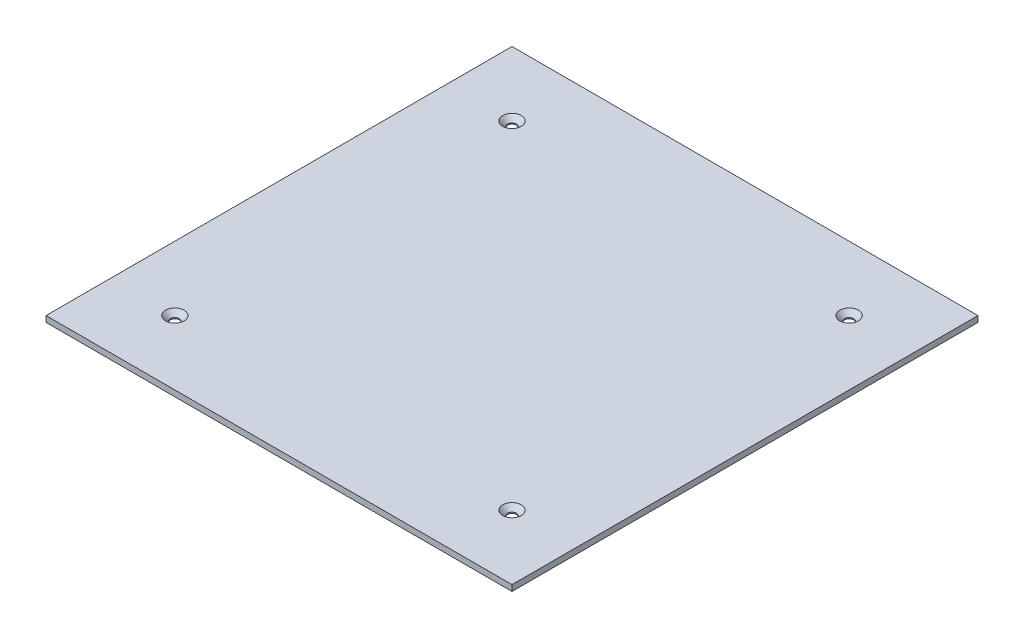
ISO-10303-21;
HEADER;
FILE_DESCRIPTION(('STEP AP214'),'2;1');
FILE_NAME('part.step','',(''),(''),'','','');
FILE_SCHEMA(('AUTOMOTIVE_DESIGN { 1 0 10303 214 1 1 1 1 }'));
ENDSEC;
DATA;
#1=APPLICATION_CONTEXT('core data for automotive mechanical design processes');
#2=APPLICATION_PROTOCOL_DEFINITION('international standard','automotive_design',2000,#1);
#3=PRODUCT_CONTEXT('',#1,'mechanical');
#4=PRODUCT('Part','Part','',(#3));
#5=PRODUCT_RELATED_PRODUCT_CATEGORY('part','',(#4));
#6=PRODUCT_DEFINITION_FORMATION('','',#4);
#7=PRODUCT_DEFINITION_CONTEXT('part definition',#1,'design');
#8=PRODUCT_DEFINITION('design','',#6,#7);
#9=PRODUCT_DEFINITION_SHAPE('','',#8);
#10=(LENGTH_UNIT() NAMED_UNIT(*) SI_UNIT(.MILLI.,.METRE.));
#11=(NAMED_UNIT(*) PLANE_ANGLE_UNIT() SI_UNIT($,.RADIAN.));
#12=(NAMED_UNIT(*) SI_UNIT($,.STERADIAN.) SOLID_ANGLE_UNIT());
#13=UNCERTAINTY_MEASURE_WITH_UNIT(LENGTH_MEASURE(1.E-05),#10,'distance_accuracy_value','');
#14=(GEOMETRIC_REPRESENTATION_CONTEXT(3) GLOBAL_UNCERTAINTY_ASSIGNED_CONTEXT((#13)) GLOBAL_UNIT_ASSIGNED_CONTEXT((#10,
#11,#12)) REPRESENTATION_CONTEXT('',''));
#15=CARTESIAN_POINT('',(0.,0.,0.));
#16=DIRECTION('',(0.,0.,1.));
#17=DIRECTION('',(1.,0.,0.));
#18=AXIS2_PLACEMENT_3D('',#15,#16,#17);
#19=CARTESIAN_POINT('',(0.,0.,0.));
#20=DIRECTION('',(0.,1.,0.));
#21=DIRECTION('',(0.,0.,1.));
#22=AXIS2_PLACEMENT_3D('',#19,#20,#21);
#23=PLANE('',#22);
#24=DIRECTION('',(0.,0.,-1.));
#25=VECTOR('',#24,1.);
#26=CARTESIAN_POINT('',(-69.5,0.,-109.5));
#27=LINE('',#26,#25);
#28=CARTESIAN_POINT('',(-69.5,0.,-97.5));
#29=VERTEX_POINT('',#28);
#30=CARTESIAN_POINT('',(-69.5,0.,-109.5));
#31=VERTEX_POINT('',#30);
#32=EDGE_CURVE('E166',#29,#31,#27,.T.);
#33=ORIENTED_EDGE('',*,*,#32,.F.);
#34=DIRECTION('',(-1.,0.,0.));
#35=VECTOR('',#34,1.);
#36=CARTESIAN_POINT('',(-69.5,0.,-97.5));
#37=LINE('',#36,#35);
#38=CARTESIAN_POINT('',(-59.5,0.,-97.5));
#39=VERTEX_POINT('',#38);
#40=EDGE_CURVE('E181',#39,#29,#37,.T.);
#41=ORIENTED_EDGE('',*,*,#40,.F.);
#42=DIRECTION('',(0.,0.,1.));
#43=VECTOR('',#42,1.);
#44=CARTESIAN_POINT('',(-59.5,0.,-109.5));
#45=LINE('',#44,#43);
#46=CARTESIAN_POINT('',(-59.5,0.,-109.5));
#47=VERTEX_POINT('',#46);
#48=EDGE_CURVE('E193',#47,#39,#45,.T.);
#49=ORIENTED_EDGE('',*,*,#48,.F.);
#50=DIRECTION('',(1.,0.,0.));
#51=VECTOR('',#50,1.);
#52=CARTESIAN_POINT('',(-69.5,0.,-109.5));
#53=LINE('',#52,#51);
#54=EDGE_CURVE('E170',#31,#47,#53,.T.);
#55=ORIENTED_EDGE('',*,*,#54,.F.);
#56=EDGE_LOOP('',(#33,#41,#49,#55));
#57=FACE_BOUND('',#56,.T.);
#58=CARTESIAN_POINT('',(-85.0000000000001,0.,-85.000000000001));
#59=DIRECTION('',(0.,1.,0.));
#60=DIRECTION('',(0.,0.,1.));
#61=AXIS2_PLACEMENT_3D('',#58,#59,#60);
#62=CIRCLE('',#61,2.25);
#63=CARTESIAN_POINT('',(-85.0000000000001,0.,-82.750000000001));
#64=VERTEX_POINT('',#63);
#65=EDGE_CURVE('E220',#64,#64,#62,.T.);
#66=ORIENTED_EDGE('',*,*,#65,.T.);
#67=EDGE_LOOP('',(#66));
#68=FACE_BOUND('',#67,.T.);
#69=CARTESIAN_POINT('',(84.9999999999999,0.,-84.9999999999992));
#70=DIRECTION('',(0.,1.,0.));
#71=DIRECTION('',(0.,0.,1.));
#72=AXIS2_PLACEMENT_3D('',#69,#70,#71);
#73=CIRCLE('',#72,2.25);
#74=CARTESIAN_POINT('',(84.9999999999999,0.,-82.7499999999992));
#75=VERTEX_POINT('',#74);
#76=EDGE_CURVE('E231',#75,#75,#73,.T.);
#77=ORIENTED_EDGE('',*,*,#76,.T.);
#78=EDGE_LOOP('',(#77));
#79=FACE_BOUND('',#78,.T.);
#80=CARTESIAN_POINT('',(84.9999999999999,0.,85.0000000000008));
#81=DIRECTION('',(0.,1.,0.));
#82=DIRECTION('',(0.,0.,1.));
#83=AXIS2_PLACEMENT_3D('',#80,#81,#82);
#84=CIRCLE('',#83,2.25);
#85=CARTESIAN_POINT('',(84.9999999999999,0.,87.2500000000008));
#86=VERTEX_POINT('',#85);
#87=EDGE_CURVE('E243',#86,#86,#84,.T.);
#88=ORIENTED_EDGE('',*,*,#87,.T.);
#89=EDGE_LOOP('',(#88));
#90=FACE_BOUND('',#89,.T.);
#91=CARTESIAN_POINT('',(-85.0000000000001,0.,84.999999999999));
#92=DIRECTION('',(0.,1.,0.));
#93=DIRECTION('',(0.,0.,1.));
#94=AXIS2_PLACEMENT_3D('',#91,#92,#93);
#95=CIRCLE('',#94,2.25);
#96=CARTESIAN_POINT('',(-85.0000000000001,0.,87.249999999999));
#97=VERTEX_POINT('',#96);
#98=EDGE_CURVE('E255',#97,#97,#95,.T.);
#99=ORIENTED_EDGE('',*,*,#98,.T.);
#100=EDGE_LOOP('',(#99));
#101=FACE_BOUND('',#100,.T.);
#102=DIRECTION('',(-1.,0.,0.));
#103=VECTOR('',#102,1.);
#104=CARTESIAN_POINT('',(117.5,0.,-117.5));
#105=LINE('',#104,#103);
#106=CARTESIAN_POINT('',(117.5,0.,-117.5));
#107=VERTEX_POINT('',#106);
#108=CARTESIAN_POINT('',(-117.5,0.,-117.5));
#109=VERTEX_POINT('',#108);
#110=EDGE_CURVE('E259',#107,#109,#105,.T.);
#111=ORIENTED_EDGE('',*,*,#110,.F.);
#112=DIRECTION('',(0.,0.,1.));
#113=VECTOR('',#112,1.);
#114=CARTESIAN_POINT('',(117.5,0.,-117.5));
#115=LINE('',#114,#113);
#116=CARTESIAN_POINT('',(117.5,0.,117.5));
#117=VERTEX_POINT('',#116);
#118=EDGE_CURVE('E265',#107,#117,#115,.T.);
#119=ORIENTED_EDGE('',*,*,#118,.T.);
#120=DIRECTION('',(-1.,0.,0.));
#121=VECTOR('',#120,1.);
#122=CARTESIAN_POINT('',(117.5,0.,117.5));
#123=LINE('',#122,#121);
#124=CARTESIAN_POINT('',(-117.5,0.,117.5));
#125=VERTEX_POINT('',#124);
#126=EDGE_CURVE('E284',#117,#125,#123,.T.);
#127=ORIENTED_EDGE('',*,*,#126,.T.);
#128=DIRECTION('',(0.,0.,1.));
#129=VECTOR('',#128,1.);
#130=CARTESIAN_POINT('',(-117.5,0.,-117.5));
#131=LINE('',#130,#129);
#132=EDGE_CURVE('E280',#109,#125,#131,.T.);
#133=ORIENTED_EDGE('',*,*,#132,.F.);
#134=EDGE_LOOP('',(#111,#119,#127,#133));
#135=FACE_BOUND('',#134,.T.);
#136=DIRECTION('',(0.,0.,-1.));
#137=VECTOR('',#136,1.);
#138=CARTESIAN_POINT('',(-52.5,0.,-115.5));
#139=LINE('',#138,#137);
#140=CARTESIAN_POINT('',(-52.5,0.,-95.5));
#141=VERTEX_POINT('',#140);
#142=CARTESIAN_POINT('',(-52.5,0.,-115.5));
#143=VERTEX_POINT('',#142);
#144=EDGE_CURVE('E164',#141,#143,#139,.T.);
#145=ORIENTED_EDGE('',*,*,#144,.F.);
#146=DIRECTION('',(-1.,0.,0.));
#147=VECTOR('',#146,1.);
#148=CARTESIAN_POINT('',(-52.5,0.,-95.5));
#149=LINE('',#148,#147);
#150=CARTESIAN_POINT('',(-35.5,0.,-95.5));
#151=VERTEX_POINT('',#150);
#152=EDGE_CURVE('E161',#151,#141,#149,.T.);
#153=ORIENTED_EDGE('',*,*,#152,.F.);
#154=DIRECTION('',(0.,0.,1.));
#155=VECTOR('',#154,1.);
#156=CARTESIAN_POINT('',(-35.5,0.,-115.5));
#157=LINE('',#156,#155);
#158=CARTESIAN_POINT('',(-35.5,0.,-115.5));
#159=VERTEX_POINT('',#158);
#160=EDGE_CURVE('E65',#159,#151,#157,.T.);
#161=ORIENTED_EDGE('',*,*,#160,.F.);
#162=DIRECTION('',(1.,0.,0.));
#163=VECTOR('',#162,1.);
#164=CARTESIAN_POINT('',(-52.5,0.,-115.5));
#165=LINE('',#164,#163);
#166=EDGE_CURVE('E57',#143,#159,#165,.T.);
#167=ORIENTED_EDGE('',*,*,#166,.F.);
#168=EDGE_LOOP('',(#145,#153,#161,#167));
#169=FACE_BOUND('',#168,.T.);
#170=ADVANCED_FACE('F39',(#57,#68,#79,#90,#101,#135,#169),#23,.F.);
#171=CARTESIAN_POINT('',(117.5,3.,-117.5));
#172=DIRECTION('',(0.,0.,1.));
#173=DIRECTION('',(1.,0.,0.));
#174=AXIS2_PLACEMENT_3D('',#171,#172,#173);
#175=PLANE('',#174);
#176=ORIENTED_EDGE('',*,*,#110,.T.);
#177=DIRECTION('',(0.,-1.,0.));
#178=VECTOR('',#177,1.);
#179=CARTESIAN_POINT('',(-117.5,3.,-117.5));
#180=LINE('',#179,#178);
#181=CARTESIAN_POINT('',(-117.5,3.,-117.5));
#182=VERTEX_POINT('',#181);
#183=EDGE_CURVE('E11',#182,#109,#180,.T.);
#184=ORIENTED_EDGE('',*,*,#183,.F.);
#185=DIRECTION('',(-1.,0.,0.));
#186=VECTOR('',#185,1.);
#187=CARTESIAN_POINT('',(117.5,3.,-117.5));
#188=LINE('',#187,#186);
#189=CARTESIAN_POINT('',(117.5,3.,-117.5));
#190=VERTEX_POINT('',#189);
#191=EDGE_CURVE('E260',#190,#182,#188,.T.);
#192=ORIENTED_EDGE('',*,*,#191,.F.);
#193=DIRECTION('',(0.,-1.,0.));
#194=VECTOR('',#193,1.);
#195=CARTESIAN_POINT('',(117.5,3.,-117.5));
#196=LINE('',#195,#194);
#197=EDGE_CURVE('E276',#190,#107,#196,.T.);
#198=ORIENTED_EDGE('',*,*,#197,.T.);
#199=EDGE_LOOP('',(#176,#184,#192,#198));
#200=FACE_BOUND('',#199,.T.);
#201=ADVANCED_FACE('F41',(#200),#175,.F.);
#202=CARTESIAN_POINT('',(-117.5,3.,-117.5));
#203=DIRECTION('',(1.,0.,0.));
#204=DIRECTION('',(0.,0.,-1.));
#205=AXIS2_PLACEMENT_3D('',#202,#203,#204);
#206=PLANE('',#205);
#207=ORIENTED_EDGE('',*,*,#132,.T.);
#208=DIRECTION('',(0.,-1.,0.));
#209=VECTOR('',#208,1.);
#210=CARTESIAN_POINT('',(-117.5,3.,117.5));
#211=LINE('',#210,#209);
#212=CARTESIAN_POINT('',(-117.5,3.,117.5));
#213=VERTEX_POINT('',#212);
#214=EDGE_CURVE('E47',#213,#125,#211,.T.);
#215=ORIENTED_EDGE('',*,*,#214,.F.);
#216=DIRECTION('',(0.,0.,1.));
#217=VECTOR('',#216,1.);
#218=CARTESIAN_POINT('',(-117.5,3.,-117.5));
#219=LINE('',#218,#217);
#220=EDGE_CURVE('E264',#182,#213,#219,.T.);
#221=ORIENTED_EDGE('',*,*,#220,.F.);
#222=ORIENTED_EDGE('',*,*,#183,.T.);
#223=EDGE_LOOP('',(#207,#215,#221,#222));
#224=FACE_BOUND('',#223,.T.);
#225=ADVANCED_FACE('F300',(#224),#206,.F.);
#226=CARTESIAN_POINT('',(117.5,3.,117.5));
#227=DIRECTION('',(0.,0.,1.));
#228=DIRECTION('',(1.,0.,0.));
#229=AXIS2_PLACEMENT_3D('',#226,#227,#228);
#230=PLANE('',#229);
#231=ORIENTED_EDGE('',*,*,#126,.F.);
#232=DIRECTION('',(0.,-1.,0.));
#233=VECTOR('',#232,1.);
#234=CARTESIAN_POINT('',(117.5,3.,117.5));
#235=LINE('',#234,#233);
#236=CARTESIAN_POINT('',(117.5,3.,117.5));
#237=VERTEX_POINT('',#236);
#238=EDGE_CURVE('E292',#237,#117,#235,.T.);
#239=ORIENTED_EDGE('',*,*,#238,.F.);
#240=DIRECTION('',(-1.,0.,0.));
#241=VECTOR('',#240,1.);
#242=CARTESIAN_POINT('',(117.5,3.,117.5));
#243=LINE('',#242,#241);
#244=EDGE_CURVE('E268',#237,#213,#243,.T.);
#245=ORIENTED_EDGE('',*,*,#244,.T.);
#246=ORIENTED_EDGE('',*,*,#214,.T.);
#247=EDGE_LOOP('',(#231,#239,#245,#246));
#248=FACE_BOUND('',#247,.T.);
#249=ADVANCED_FACE('F297',(#248),#230,.T.);
#250=CARTESIAN_POINT('',(117.5,3.,-117.5));
#251=DIRECTION('',(1.,0.,0.));
#252=DIRECTION('',(0.,0.,-1.));
#253=AXIS2_PLACEMENT_3D('',#250,#251,#252);
#254=PLANE('',#253);
#255=ORIENTED_EDGE('',*,*,#118,.F.);
#256=ORIENTED_EDGE('',*,*,#197,.F.);
#257=DIRECTION('',(0.,0.,1.));
#258=VECTOR('',#257,1.);
#259=CARTESIAN_POINT('',(117.5,3.,-117.5));
#260=LINE('',#259,#258);
#261=EDGE_CURVE('E272',#190,#237,#260,.T.);
#262=ORIENTED_EDGE('',*,*,#261,.T.);
#263=ORIENTED_EDGE('',*,*,#238,.T.);
#264=EDGE_LOOP('',(#255,#256,#262,#263));
#265=FACE_BOUND('',#264,.T.);
#266=ADVANCED_FACE('F306',(#265),#254,.T.);
#267=CARTESIAN_POINT('',(0.,3.,0.));
#268=DIRECTION('',(0.,1.,0.));
#269=DIRECTION('',(0.,0.,1.));
#270=AXIS2_PLACEMENT_3D('',#267,#268,#269);
#271=PLANE('',#270);
#272=CARTESIAN_POINT('',(-85.0000000000001,3.,-85.000000000001));
#273=DIRECTION('',(0.,1.,0.));
#274=DIRECTION('',(0.,0.,1.));
#275=AXIS2_PLACEMENT_3D('',#272,#273,#274);
#276=CIRCLE('',#275,4.7);
#277=CARTESIAN_POINT('',(-85.0000000000001,3.,-80.300000000001));
#278=VERTEX_POINT('',#277);
#279=EDGE_CURVE('E214',#278,#278,#276,.T.);
#280=ORIENTED_EDGE('',*,*,#279,.F.);
#281=EDGE_LOOP('',(#280));
#282=FACE_BOUND('',#281,.T.);
#283=CARTESIAN_POINT('',(84.9999999999999,3.,-84.9999999999992));
#284=DIRECTION('',(0.,1.,0.));
#285=DIRECTION('',(0.,0.,1.));
#286=AXIS2_PLACEMENT_3D('',#283,#284,#285);
#287=CIRCLE('',#286,4.7);
#288=CARTESIAN_POINT('',(84.9999999999999,3.,-80.2999999999992));
#289=VERTEX_POINT('',#288);
#290=EDGE_CURVE('E223',#289,#289,#287,.T.);
#291=ORIENTED_EDGE('',*,*,#290,.F.);
#292=EDGE_LOOP('',(#291));
#293=FACE_BOUND('',#292,.T.);
#294=CARTESIAN_POINT('',(84.9999999999999,3.,85.0000000000008));
#295=DIRECTION('',(0.,1.,0.));
#296=DIRECTION('',(0.,0.,1.));
#297=AXIS2_PLACEMENT_3D('',#294,#295,#296);
#298=CIRCLE('',#297,4.7);
#299=CARTESIAN_POINT('',(84.9999999999999,3.,89.7000000000008));
#300=VERTEX_POINT('',#299);
#301=EDGE_CURVE('E235',#300,#300,#298,.T.);
#302=ORIENTED_EDGE('',*,*,#301,.F.);
#303=EDGE_LOOP('',(#302));
#304=FACE_BOUND('',#303,.T.);
#305=CARTESIAN_POINT('',(-85.0000000000001,3.,84.999999999999));
#306=DIRECTION('',(0.,1.,0.));
#307=DIRECTION('',(0.,0.,1.));
#308=AXIS2_PLACEMENT_3D('',#305,#306,#307);
#309=CIRCLE('',#308,4.7);
#310=CARTESIAN_POINT('',(-85.0000000000001,3.,89.699999999999));
#311=VERTEX_POINT('',#310);
#312=EDGE_CURVE('E247',#311,#311,#309,.T.);
#313=ORIENTED_EDGE('',*,*,#312,.F.);
#314=EDGE_LOOP('',(#313));
#315=FACE_BOUND('',#314,.T.);
#316=ORIENTED_EDGE('',*,*,#191,.T.);
#317=ORIENTED_EDGE('',*,*,#220,.T.);
#318=ORIENTED_EDGE('',*,*,#244,.F.);
#319=ORIENTED_EDGE('',*,*,#261,.F.);
#320=EDGE_LOOP('',(#316,#317,#318,#319));
#321=FACE_BOUND('',#320,.T.);
#322=ADVANCED_FACE('F310',(#282,#293,#304,#315,#321),#271,.T.);
#323=CARTESIAN_POINT('',(-85.0000000000001,3.,84.999999999999));
#324=DIRECTION('',(0.,1.,0.));
#325=DIRECTION('',(0.,0.,1.));
#326=AXIS2_PLACEMENT_3D('',#323,#324,#325);
#327=CYLINDRICAL_SURFACE('',#326,2.25);
#328=ORIENTED_EDGE('',*,*,#98,.F.);
#329=EDGE_LOOP('',(#328));
#330=FACE_BOUND('',#329,.T.);
#331=CARTESIAN_POINT('',(-85.0000000000001,0.55,84.999999999999));
#332=DIRECTION('',(0.,1.,0.));
#333=DIRECTION('',(0.,0.,1.));
#334=AXIS2_PLACEMENT_3D('',#331,#332,#333);
#335=CIRCLE('',#334,2.25);
#336=CARTESIAN_POINT('',(-85.0000000000001,0.55,87.249999999999));
#337=VERTEX_POINT('',#336);
#338=EDGE_CURVE('E251',#337,#337,#335,.T.);
#339=ORIENTED_EDGE('',*,*,#338,.T.);
#340=EDGE_LOOP('',(#339));
#341=FACE_BOUND('',#340,.T.);
#342=ADVANCED_FACE('F340',(#330,#341),#327,.F.);
#343=CARTESIAN_POINT('',(-85.0000000000001,3.,84.999999999999));
#344=DIRECTION('',(0.,1.,0.));
#345=DIRECTION('',(0.,0.,1.));
#346=AXIS2_PLACEMENT_3D('',#343,#344,#345);
#347=CONICAL_SURFACE('',#346,4.7,0.785398163397447);
#348=ORIENTED_EDGE('',*,*,#338,.F.);
#349=EDGE_LOOP('',(#348));
#350=FACE_BOUND('',#349,.T.);
#351=ORIENTED_EDGE('',*,*,#312,.T.);
#352=EDGE_LOOP('',(#351));
#353=FACE_BOUND('',#352,.T.);
#354=ADVANCED_FACE('F346',(#350,#353),#347,.F.);
#355=CARTESIAN_POINT('',(84.9999999999999,3.,85.0000000000008));
#356=DIRECTION('',(0.,1.,0.));
#357=DIRECTION('',(0.,0.,1.));
#358=AXIS2_PLACEMENT_3D('',#355,#356,#357);
#359=CYLINDRICAL_SURFACE('',#358,2.25);
#360=ORIENTED_EDGE('',*,*,#87,.F.);
#361=EDGE_LOOP('',(#360));
#362=FACE_BOUND('',#361,.T.);
#363=CARTESIAN_POINT('',(84.9999999999999,0.55,85.0000000000008));
#364=DIRECTION('',(0.,1.,0.));
#365=DIRECTION('',(0.,0.,1.));
#366=AXIS2_PLACEMENT_3D('',#363,#364,#365);
#367=CIRCLE('',#366,2.25);
#368=CARTESIAN_POINT('',(84.9999999999999,0.55,87.2500000000008));
#369=VERTEX_POINT('',#368);
#370=EDGE_CURVE('E239',#369,#369,#367,.T.);
#371=ORIENTED_EDGE('',*,*,#370,.T.);
#372=EDGE_LOOP('',(#371));
#373=FACE_BOUND('',#372,.T.);
#374=ADVANCED_FACE('F353',(#362,#373),#359,.F.);
#375=CARTESIAN_POINT('',(84.9999999999999,3.,85.0000000000008));
#376=DIRECTION('',(0.,1.,0.));
#377=DIRECTION('',(0.,0.,1.));
#378=AXIS2_PLACEMENT_3D('',#375,#376,#377);
#379=CONICAL_SURFACE('',#378,4.7,0.785398163397447);
#380=ORIENTED_EDGE('',*,*,#370,.F.);
#381=EDGE_LOOP('',(#380));
#382=FACE_BOUND('',#381,.T.);
#383=ORIENTED_EDGE('',*,*,#301,.T.);
#384=EDGE_LOOP('',(#383));
#385=FACE_BOUND('',#384,.T.);
#386=ADVANCED_FACE('F361',(#382,#385),#379,.F.);
#387=CARTESIAN_POINT('',(84.9999999999999,3.,-84.9999999999992));
#388=DIRECTION('',(0.,1.,0.));
#389=DIRECTION('',(0.,0.,1.));
#390=AXIS2_PLACEMENT_3D('',#387,#388,#389);
#391=CYLINDRICAL_SURFACE('',#390,2.25);
#392=ORIENTED_EDGE('',*,*,#76,.F.);
#393=EDGE_LOOP('',(#392));
#394=FACE_BOUND('',#393,.T.);
#395=CARTESIAN_POINT('',(84.9999999999999,0.55,-84.9999999999992));
#396=DIRECTION('',(0.,1.,0.));
#397=DIRECTION('',(0.,0.,1.));
#398=AXIS2_PLACEMENT_3D('',#395,#396,#397);
#399=CIRCLE('',#398,2.25);
#400=CARTESIAN_POINT('',(84.9999999999999,0.55,-82.7499999999992));
#401=VERTEX_POINT('',#400);
#402=EDGE_CURVE('E227',#401,#401,#399,.T.);
#403=ORIENTED_EDGE('',*,*,#402,.T.);
#404=EDGE_LOOP('',(#403));
#405=FACE_BOUND('',#404,.T.);
#406=ADVANCED_FACE('F369',(#394,#405),#391,.F.);
#407=CARTESIAN_POINT('',(84.9999999999999,3.,-84.9999999999992));
#408=DIRECTION('',(0.,1.,0.));
#409=DIRECTION('',(0.,0.,1.));
#410=AXIS2_PLACEMENT_3D('',#407,#408,#409);
#411=CONICAL_SURFACE('',#410,4.7,0.785398163397447);
#412=ORIENTED_EDGE('',*,*,#402,.F.);
#413=EDGE_LOOP('',(#412));
#414=FACE_BOUND('',#413,.T.);
#415=ORIENTED_EDGE('',*,*,#290,.T.);
#416=EDGE_LOOP('',(#415));
#417=FACE_BOUND('',#416,.T.);
#418=ADVANCED_FACE('F377',(#414,#417),#411,.F.);
#419=CARTESIAN_POINT('',(-85.0000000000001,3.,-85.000000000001));
#420=DIRECTION('',(0.,1.,0.));
#421=DIRECTION('',(0.,0.,1.));
#422=AXIS2_PLACEMENT_3D('',#419,#420,#421);
#423=CYLINDRICAL_SURFACE('',#422,2.25);
#424=ORIENTED_EDGE('',*,*,#65,.F.);
#425=EDGE_LOOP('',(#424));
#426=FACE_BOUND('',#425,.T.);
#427=CARTESIAN_POINT('',(-85.0000000000001,0.55,-85.000000000001));
#428=DIRECTION('',(0.,1.,0.));
#429=DIRECTION('',(0.,0.,1.));
#430=AXIS2_PLACEMENT_3D('',#427,#428,#429);
#431=CIRCLE('',#430,2.25);
#432=CARTESIAN_POINT('',(-85.0000000000001,0.55,-82.750000000001));
#433=VERTEX_POINT('',#432);
#434=EDGE_CURVE('E217',#433,#433,#431,.T.);
#435=ORIENTED_EDGE('',*,*,#434,.T.);
#436=EDGE_LOOP('',(#435));
#437=FACE_BOUND('',#436,.T.);
#438=ADVANCED_FACE('F385',(#426,#437),#423,.F.);
#439=CARTESIAN_POINT('',(-85.0000000000001,3.,-85.000000000001));
#440=DIRECTION('',(0.,1.,0.));
#441=DIRECTION('',(0.,0.,1.));
#442=AXIS2_PLACEMENT_3D('',#439,#440,#441);
#443=CONICAL_SURFACE('',#442,4.7,0.785398163397447);
#444=ORIENTED_EDGE('',*,*,#434,.F.);
#445=EDGE_LOOP('',(#444));
#446=FACE_BOUND('',#445,.T.);
#447=ORIENTED_EDGE('',*,*,#279,.T.);
#448=EDGE_LOOP('',(#447));
#449=FACE_BOUND('',#448,.T.);
#450=ADVANCED_FACE('F393',(#446,#449),#443,.F.);
#451=CARTESIAN_POINT('',(-69.5,-15.,-109.5));
#452=DIRECTION('',(1.,0.,0.));
#453=DIRECTION('',(0.,0.,-1.));
#454=AXIS2_PLACEMENT_3D('',#451,#452,#453);
#455=PLANE('',#454);
#456=ORIENTED_EDGE('',*,*,#32,.T.);
#457=DIRECTION('',(0.,1.,0.));
#458=VECTOR('',#457,1.);
#459=CARTESIAN_POINT('',(-69.5,-15.,-109.5));
#460=LINE('',#459,#458);
#461=CARTESIAN_POINT('',(-69.5,-15.,-109.5));
#462=VERTEX_POINT('',#461);
#463=EDGE_CURVE('E211',#462,#31,#460,.T.);
#464=ORIENTED_EDGE('',*,*,#463,.F.);
#465=DIRECTION('',(0.,0.,-1.));
#466=VECTOR('',#465,1.);
#467=CARTESIAN_POINT('',(-69.5,-15.,-109.5));
#468=LINE('',#467,#466);
#469=CARTESIAN_POINT('',(-69.5,-15.,-97.5));
#470=VERTEX_POINT('',#469);
#471=EDGE_CURVE('E177',#470,#462,#468,.T.);
#472=ORIENTED_EDGE('',*,*,#471,.F.);
#473=DIRECTION('',(0.,1.,0.));
#474=VECTOR('',#473,1.);
#475=CARTESIAN_POINT('',(-69.5,-15.,-97.5));
#476=LINE('',#475,#474);
#477=EDGE_CURVE('E188',#470,#29,#476,.T.);
#478=ORIENTED_EDGE('',*,*,#477,.T.);
#479=EDGE_LOOP('',(#456,#464,#472,#478));
#480=FACE_BOUND('',#479,.T.);
#481=ADVANCED_FACE('F401',(#480),#455,.F.);
#482=CARTESIAN_POINT('',(-69.5,-15.,-109.5));
#483=DIRECTION('',(0.,0.,1.));
#484=DIRECTION('',(1.,0.,0.));
#485=AXIS2_PLACEMENT_3D('',#482,#483,#484);
#486=PLANE('',#485);
#487=ORIENTED_EDGE('',*,*,#54,.T.);
#488=DIRECTION('',(0.,1.,0.));
#489=VECTOR('',#488,1.);
#490=CARTESIAN_POINT('',(-59.5,-15.,-109.5));
#491=LINE('',#490,#489);
#492=CARTESIAN_POINT('',(-59.5,-15.,-109.5));
#493=VERTEX_POINT('',#492);
#494=EDGE_CURVE('E207',#493,#47,#491,.T.);
#495=ORIENTED_EDGE('',*,*,#494,.F.);
#496=DIRECTION('',(1.,0.,0.));
#497=VECTOR('',#496,1.);
#498=CARTESIAN_POINT('',(-69.5,-15.,-109.5));
#499=LINE('',#498,#497);
#500=EDGE_CURVE('E180',#462,#493,#499,.T.);
#501=ORIENTED_EDGE('',*,*,#500,.F.);
#502=ORIENTED_EDGE('',*,*,#463,.T.);
#503=EDGE_LOOP('',(#487,#495,#501,#502));
#504=FACE_BOUND('',#503,.T.);
#505=ADVANCED_FACE('F410',(#504),#486,.F.);
#506=CARTESIAN_POINT('',(-59.5,-15.,-109.5));
#507=DIRECTION('',(-1.,0.,0.));
#508=DIRECTION('',(0.,0.,1.));
#509=AXIS2_PLACEMENT_3D('',#506,#507,#508);
#510=PLANE('',#509);
#511=ORIENTED_EDGE('',*,*,#48,.T.);
#512=DIRECTION('',(0.,1.,0.));
#513=VECTOR('',#512,1.);
#514=CARTESIAN_POINT('',(-59.5,-15.,-97.5));
#515=LINE('',#514,#513);
#516=CARTESIAN_POINT('',(-59.5,-15.,-97.5));
#517=VERTEX_POINT('',#516);
#518=EDGE_CURVE('E203',#517,#39,#515,.T.);
#519=ORIENTED_EDGE('',*,*,#518,.F.);
#520=DIRECTION('',(0.,0.,1.));
#521=VECTOR('',#520,1.);
#522=CARTESIAN_POINT('',(-59.5,-15.,-109.5));
#523=LINE('',#522,#521);
#524=EDGE_CURVE('E183',#493,#517,#523,.T.);
#525=ORIENTED_EDGE('',*,*,#524,.F.);
#526=ORIENTED_EDGE('',*,*,#494,.T.);
#527=EDGE_LOOP('',(#511,#519,#525,#526));
#528=FACE_BOUND('',#527,.T.);
#529=ADVANCED_FACE('F418',(#528),#510,.F.);
#530=CARTESIAN_POINT('',(-69.5,-15.,-97.5));
#531=DIRECTION('',(0.,0.,-1.));
#532=DIRECTION('',(-1.,0.,0.));
#533=AXIS2_PLACEMENT_3D('',#530,#531,#532);
#534=PLANE('',#533);
#535=ORIENTED_EDGE('',*,*,#40,.T.);
#536=ORIENTED_EDGE('',*,*,#477,.F.);
#537=DIRECTION('',(-1.,0.,0.));
#538=VECTOR('',#537,1.);
#539=CARTESIAN_POINT('',(-69.5,-15.,-97.5));
#540=LINE('',#539,#538);
#541=EDGE_CURVE('E186',#517,#470,#540,.T.);
#542=ORIENTED_EDGE('',*,*,#541,.F.);
#543=ORIENTED_EDGE('',*,*,#518,.T.);
#544=EDGE_LOOP('',(#535,#536,#542,#543));
#545=FACE_BOUND('',#544,.T.);
#546=ADVANCED_FACE('F426',(#545),#534,.F.);
#547=CARTESIAN_POINT('',(0.,-15.,0.));
#548=DIRECTION('',(0.,1.,0.));
#549=DIRECTION('',(0.,0.,1.));
#550=AXIS2_PLACEMENT_3D('',#547,#548,#549);
#551=PLANE('',#550);
#552=ORIENTED_EDGE('',*,*,#471,.T.);
#553=ORIENTED_EDGE('',*,*,#500,.T.);
#554=ORIENTED_EDGE('',*,*,#524,.T.);
#555=ORIENTED_EDGE('',*,*,#541,.T.);
#556=EDGE_LOOP('',(#552,#553,#554,#555));
#557=FACE_BOUND('',#556,.T.);
#558=ADVANCED_FACE('F434',(#557),#551,.F.);
#559=CARTESIAN_POINT('',(-52.5,-15.,-115.5));
#560=DIRECTION('',(1.,0.,0.));
#561=DIRECTION('',(0.,0.,-1.));
#562=AXIS2_PLACEMENT_3D('',#559,#560,#561);
#563=PLANE('',#562);
#564=ORIENTED_EDGE('',*,*,#144,.T.);
#565=DIRECTION('',(0.,1.,0.));
#566=VECTOR('',#565,1.);
#567=CARTESIAN_POINT('',(-52.5,-15.,-115.5));
#568=LINE('',#567,#566);
#569=CARTESIAN_POINT('',(-52.5,-15.,-115.5));
#570=VERTEX_POINT('',#569);
#571=EDGE_CURVE('E143',#570,#143,#568,.T.);
#572=ORIENTED_EDGE('',*,*,#571,.F.);
#573=DIRECTION('',(0.,0.,-1.));
#574=VECTOR('',#573,1.);
#575=CARTESIAN_POINT('',(-52.5,-15.,-115.5));
#576=LINE('',#575,#574);
#577=CARTESIAN_POINT('',(-52.5,-15.,-95.5));
#578=VERTEX_POINT('',#577);
#579=EDGE_CURVE('E151',#578,#570,#576,.T.);
#580=ORIENTED_EDGE('',*,*,#579,.F.);
#581=DIRECTION('',(0.,1.,0.));
#582=VECTOR('',#581,1.);
#583=CARTESIAN_POINT('',(-52.5,-15.,-95.5));
#584=LINE('',#583,#582);
#585=EDGE_CURVE('E542',#578,#141,#584,.T.);
#586=ORIENTED_EDGE('',*,*,#585,.T.);
#587=EDGE_LOOP('',(#564,#572,#580,#586));
#588=FACE_BOUND('',#587,.T.);
#589=ADVANCED_FACE('F163',(#588),#563,.F.);
#590=CARTESIAN_POINT('',(-52.5,-15.,-115.5));
#591=DIRECTION('',(0.,0.,1.));
#592=DIRECTION('',(1.,0.,0.));
#593=AXIS2_PLACEMENT_3D('',#590,#591,#592);
#594=PLANE('',#593);
#595=ORIENTED_EDGE('',*,*,#166,.T.);
#596=DIRECTION('',(0.,1.,0.));
#597=VECTOR('',#596,1.);
#598=CARTESIAN_POINT('',(-35.5,-15.,-115.5));
#599=LINE('',#598,#597);
#600=CARTESIAN_POINT('',(-35.5,-15.,-115.5));
#601=VERTEX_POINT('',#600);
#602=EDGE_CURVE('E146',#601,#159,#599,.T.);
#603=ORIENTED_EDGE('',*,*,#602,.F.);
#604=DIRECTION('',(1.,0.,0.));
#605=VECTOR('',#604,1.);
#606=CARTESIAN_POINT('',(-52.5,-15.,-115.5));
#607=LINE('',#606,#605);
#608=EDGE_CURVE('E139',#570,#601,#607,.T.);
#609=ORIENTED_EDGE('',*,*,#608,.F.);
#610=ORIENTED_EDGE('',*,*,#571,.T.);
#611=EDGE_LOOP('',(#595,#603,#609,#610));
#612=FACE_BOUND('',#611,.T.);
#613=ADVANCED_FACE('F141',(#612),#594,.F.);
#614=CARTESIAN_POINT('',(-35.5,-15.,-115.5));
#615=DIRECTION('',(-1.,0.,0.));
#616=DIRECTION('',(0.,0.,1.));
#617=AXIS2_PLACEMENT_3D('',#614,#615,#616);
#618=PLANE('',#617);
#619=ORIENTED_EDGE('',*,*,#160,.T.);
#620=DIRECTION('',(0.,1.,0.));
#621=VECTOR('',#620,1.);
#622=CARTESIAN_POINT('',(-35.5,-15.,-95.5));
#623=LINE('',#622,#621);
#624=CARTESIAN_POINT('',(-35.5,-15.,-95.5));
#625=VERTEX_POINT('',#624);
#626=EDGE_CURVE('E173',#625,#151,#623,.T.);
#627=ORIENTED_EDGE('',*,*,#626,.F.);
#628=DIRECTION('',(0.,0.,1.));
#629=VECTOR('',#628,1.);
#630=CARTESIAN_POINT('',(-35.5,-15.,-115.5));
#631=LINE('',#630,#629);
#632=EDGE_CURVE('E150',#601,#625,#631,.T.);
#633=ORIENTED_EDGE('',*,*,#632,.F.);
#634=ORIENTED_EDGE('',*,*,#602,.T.);
#635=EDGE_LOOP('',(#619,#627,#633,#634));
#636=FACE_BOUND('',#635,.T.);
#637=ADVANCED_FACE('F455',(#636),#618,.F.);
#638=CARTESIAN_POINT('',(-52.5,-15.,-95.5));
#639=DIRECTION('',(0.,0.,-1.));
#640=DIRECTION('',(-1.,0.,0.));
#641=AXIS2_PLACEMENT_3D('',#638,#639,#640);
#642=PLANE('',#641);
#643=ORIENTED_EDGE('',*,*,#152,.T.);
#644=ORIENTED_EDGE('',*,*,#585,.F.);
#645=DIRECTION('',(-1.,0.,0.));
#646=VECTOR('',#645,1.);
#647=CARTESIAN_POINT('',(-52.5,-15.,-95.5));
#648=LINE('',#647,#646);
#649=EDGE_CURVE('E156',#625,#578,#648,.T.);
#650=ORIENTED_EDGE('',*,*,#649,.F.);
#651=ORIENTED_EDGE('',*,*,#626,.T.);
#652=EDGE_LOOP('',(#643,#644,#650,#651));
#653=FACE_BOUND('',#652,.T.);
#654=ADVANCED_FACE('F462',(#653),#642,.F.);
#655=CARTESIAN_POINT('',(0.,-15.,0.));
#656=DIRECTION('',(0.,1.,0.));
#657=DIRECTION('',(0.,0.,1.));
#658=AXIS2_PLACEMENT_3D('',#655,#656,#657);
#659=PLANE('',#658);
#660=ORIENTED_EDGE('',*,*,#579,.T.);
#661=ORIENTED_EDGE('',*,*,#608,.T.);
#662=ORIENTED_EDGE('',*,*,#632,.T.);
#663=ORIENTED_EDGE('',*,*,#649,.T.);
#664=EDGE_LOOP('',(#660,#661,#662,#663));
#665=FACE_BOUND('',#664,.T.);
#666=ADVANCED_FACE('F154',(#665),#659,.F.);
#667=CLOSED_SHELL('',(#170,#201,#225,#249,#266,#322,#342,#354,#374,#386,#406,#418,#438,#450,
#481,#505,#529,#546,#558,#589,#613,#637,#654,#666));
#668=MANIFOLD_SOLID_BREP('B2',#667);
#669=ADVANCED_BREP_SHAPE_REPRESENTATION('',(#18,#668),#14);
#670=SHAPE_DEFINITION_REPRESENTATION(#9,#669);
ENDSEC;
END-ISO-10303-21;
